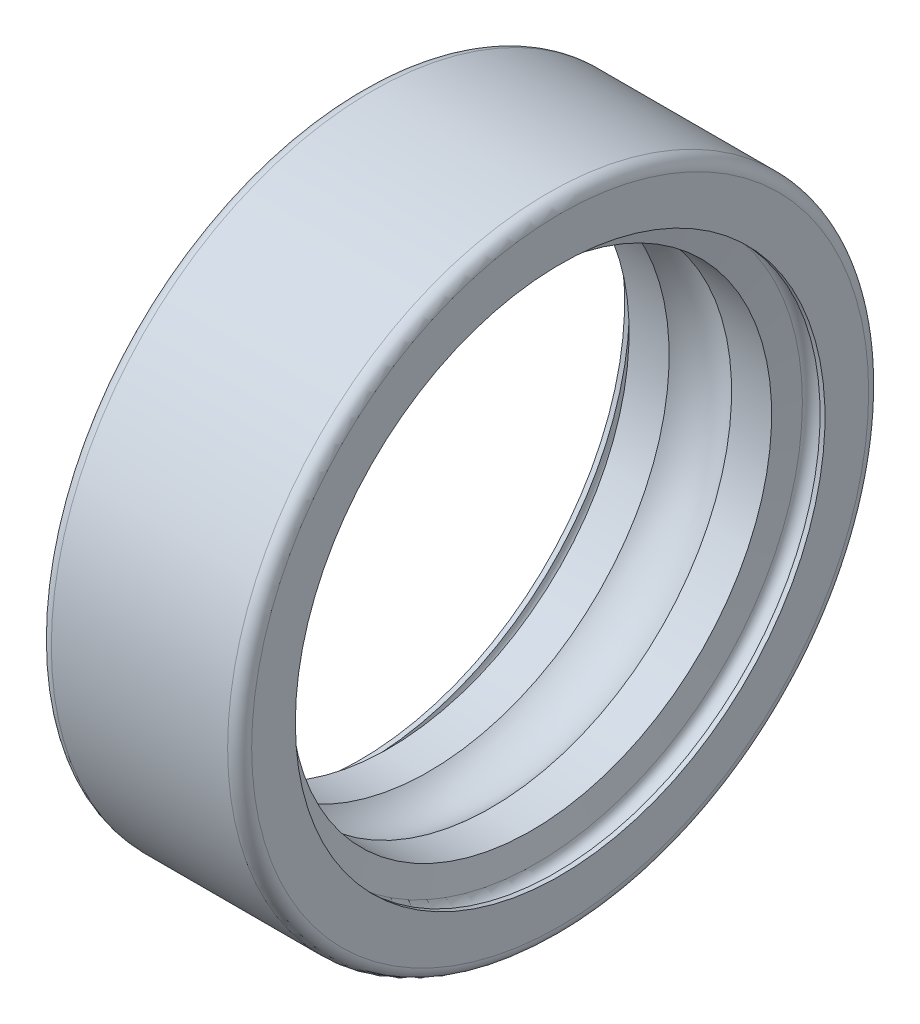
ISO-10303-21;
HEADER;
FILE_DESCRIPTION(('STEP AP214'),'2;1');
FILE_NAME('part.step','',(''),(''),'','','');
FILE_SCHEMA(('AUTOMOTIVE_DESIGN { 1 0 10303 214 1 1 1 1 }'));
ENDSEC;
DATA;
#1=APPLICATION_CONTEXT('core data for automotive mechanical design processes');
#2=APPLICATION_PROTOCOL_DEFINITION('international standard','automotive_design',2000,#1);
#3=PRODUCT_CONTEXT('',#1,'mechanical');
#4=PRODUCT('Part','Part','',(#3));
#5=PRODUCT_RELATED_PRODUCT_CATEGORY('part','',(#4));
#6=PRODUCT_DEFINITION_FORMATION('','',#4);
#7=PRODUCT_DEFINITION_CONTEXT('part definition',#1,'design');
#8=PRODUCT_DEFINITION('design','',#6,#7);
#9=PRODUCT_DEFINITION_SHAPE('','',#8);
#10=(LENGTH_UNIT() NAMED_UNIT(*) SI_UNIT(.MILLI.,.METRE.));
#11=(NAMED_UNIT(*) PLANE_ANGLE_UNIT() SI_UNIT($,.RADIAN.));
#12=(NAMED_UNIT(*) SI_UNIT($,.STERADIAN.) SOLID_ANGLE_UNIT());
#13=UNCERTAINTY_MEASURE_WITH_UNIT(LENGTH_MEASURE(1.E-05),#10,'distance_accuracy_value','');
#14=(GEOMETRIC_REPRESENTATION_CONTEXT(3) GLOBAL_UNCERTAINTY_ASSIGNED_CONTEXT((#13)) GLOBAL_UNIT_ASSIGNED_CONTEXT((#10,
#11,#12)) REPRESENTATION_CONTEXT('',''));
#15=CARTESIAN_POINT('',(0.,0.,0.));
#16=DIRECTION('',(0.,0.,1.));
#17=DIRECTION('',(1.,0.,0.));
#18=AXIS2_PLACEMENT_3D('',#15,#16,#17);
#19=CARTESIAN_POINT('',(4.27867644846772,0.,0.));
#20=DIRECTION('',(1.,0.,0.));
#21=DIRECTION('',(0.,0.,-1.));
#22=AXIS2_PLACEMENT_3D('',#19,#20,#21);
#23=CONICAL_SURFACE('',#22,6.,1.39626340159546);
#24=CARTESIAN_POINT('',(4.39370690826502,0.,0.));
#25=DIRECTION('',(-1.,0.,0.));
#26=DIRECTION('',(0.,0.,1.));
#27=AXIS2_PLACEMENT_3D('',#24,#25,#26);
#28=CIRCLE('',#27,6.65237015535073);
#29=CARTESIAN_POINT('',(4.39370690826502,0.,6.65237015535073));
#30=VERTEX_POINT('',#29);
#31=EDGE_CURVE('E10',#30,#30,#28,.T.);
#32=ORIENTED_EDGE('',*,*,#31,.F.);
#33=EDGE_LOOP('',(#32));
#34=FACE_BOUND('',#33,.T.);
#35=CARTESIAN_POINT('',(4.27867644846772,0.,0.));
#36=DIRECTION('',(-1.,0.,0.));
#37=DIRECTION('',(0.,0.,1.));
#38=AXIS2_PLACEMENT_3D('',#35,#36,#37);
#39=CIRCLE('',#38,6.);
#40=CARTESIAN_POINT('',(4.27867644846772,0.,6.));
#41=VERTEX_POINT('',#40);
#42=EDGE_CURVE('E80',#41,#41,#39,.T.);
#43=ORIENTED_EDGE('',*,*,#42,.T.);
#44=EDGE_LOOP('',(#43));
#45=FACE_BOUND('',#44,.T.);
#46=ADVANCED_FACE('F14',(#34,#45),#23,.F.);
#47=CARTESIAN_POINT('',(4.634,0.,0.));
#48=DIRECTION('',(-1.,0.,0.));
#49=DIRECTION('',(0.,0.,1.));
#50=AXIS2_PLACEMENT_3D('',#47,#48,#49);
#51=TOROIDAL_SURFACE('',#50,6.61,0.244);
#52=ORIENTED_EDGE('',*,*,#31,.T.);
#53=EDGE_LOOP('',(#52));
#54=FACE_BOUND('',#53,.T.);
#55=CARTESIAN_POINT('',(4.878,0.,0.));
#56=DIRECTION('',(-1.,0.,0.));
#57=DIRECTION('',(0.,0.,1.));
#58=AXIS2_PLACEMENT_3D('',#55,#56,#57);
#59=CIRCLE('',#58,6.61);
#60=CARTESIAN_POINT('',(4.878,0.,6.61));
#61=VERTEX_POINT('',#60);
#62=EDGE_CURVE('E21',#61,#61,#59,.T.);
#63=ORIENTED_EDGE('',*,*,#62,.F.);
#64=EDGE_LOOP('',(#63));
#65=FACE_BOUND('',#64,.T.);
#66=ADVANCED_FACE('F105',(#54,#65),#51,.F.);
#67=CARTESIAN_POINT('',(0.,0.,0.));
#68=DIRECTION('',(-1.,0.,0.));
#69=DIRECTION('',(0.,0.,1.));
#70=AXIS2_PLACEMENT_3D('',#67,#68,#69);
#71=CYLINDRICAL_SURFACE('',#70,6.61);
#72=ORIENTED_EDGE('',*,*,#62,.T.);
#73=EDGE_LOOP('',(#72));
#74=FACE_BOUND('',#73,.T.);
#75=CARTESIAN_POINT('',(5.,0.,0.));
#76=DIRECTION('',(-1.,0.,0.));
#77=DIRECTION('',(0.,0.,1.));
#78=AXIS2_PLACEMENT_3D('',#75,#76,#77);
#79=CIRCLE('',#78,6.61);
#80=CARTESIAN_POINT('',(5.,0.,6.61));
#81=VERTEX_POINT('',#80);
#82=EDGE_CURVE('E30',#81,#81,#79,.T.);
#83=ORIENTED_EDGE('',*,*,#82,.F.);
#84=EDGE_LOOP('',(#83));
#85=FACE_BOUND('',#84,.T.);
#86=ADVANCED_FACE('F110',(#74,#85),#71,.F.);
#87=CARTESIAN_POINT('',(5.,6.61,0.));
#88=DIRECTION('',(-1.,0.,0.));
#89=DIRECTION('',(0.,0.,1.));
#90=AXIS2_PLACEMENT_3D('',#87,#88,#89);
#91=PLANE('',#90);
#92=CARTESIAN_POINT('',(5.,0.,0.));
#93=DIRECTION('',(-1.,0.,0.));
#94=DIRECTION('',(0.,0.,1.));
#95=AXIS2_PLACEMENT_3D('',#92,#93,#94);
#96=CIRCLE('',#95,7.7);
#97=CARTESIAN_POINT('',(5.,0.,7.7));
#98=VERTEX_POINT('',#97);
#99=EDGE_CURVE('E38',#98,#98,#96,.T.);
#100=ORIENTED_EDGE('',*,*,#99,.F.);
#101=EDGE_LOOP('',(#100));
#102=FACE_BOUND('',#101,.T.);
#103=ORIENTED_EDGE('',*,*,#82,.T.);
#104=EDGE_LOOP('',(#103));
#105=FACE_BOUND('',#104,.T.);
#106=ADVANCED_FACE('F114',(#102,#105),#91,.F.);
#107=CARTESIAN_POINT('',(4.7,0.,0.));
#108=DIRECTION('',(-1.,0.,0.));
#109=DIRECTION('',(0.,0.,1.));
#110=AXIS2_PLACEMENT_3D('',#107,#108,#109);
#111=TOROIDAL_SURFACE('',#110,7.7,0.3);
#112=CARTESIAN_POINT('',(4.7,0.,0.));
#113=DIRECTION('',(-1.,0.,0.));
#114=DIRECTION('',(0.,0.,1.));
#115=AXIS2_PLACEMENT_3D('',#112,#113,#114);
#116=CIRCLE('',#115,8.);
#117=CARTESIAN_POINT('',(4.7,0.,8.));
#118=VERTEX_POINT('',#117);
#119=EDGE_CURVE('E44',#118,#118,#116,.T.);
#120=ORIENTED_EDGE('',*,*,#119,.F.);
#121=EDGE_LOOP('',(#120));
#122=FACE_BOUND('',#121,.T.);
#123=ORIENTED_EDGE('',*,*,#99,.T.);
#124=EDGE_LOOP('',(#123));
#125=FACE_BOUND('',#124,.T.);
#126=ADVANCED_FACE('F120',(#122,#125),#111,.T.);
#127=CARTESIAN_POINT('',(0.,0.,0.));
#128=DIRECTION('',(-1.,0.,0.));
#129=DIRECTION('',(0.,0.,1.));
#130=AXIS2_PLACEMENT_3D('',#127,#128,#129);
#131=CYLINDRICAL_SURFACE('',#130,8.);
#132=ORIENTED_EDGE('',*,*,#119,.T.);
#133=EDGE_LOOP('',(#132));
#134=FACE_BOUND('',#133,.T.);
#135=CARTESIAN_POINT('',(0.3,0.,0.));
#136=DIRECTION('',(-1.,0.,0.));
#137=DIRECTION('',(0.,0.,1.));
#138=AXIS2_PLACEMENT_3D('',#135,#136,#137);
#139=CIRCLE('',#138,8.);
#140=CARTESIAN_POINT('',(0.3,0.,8.));
#141=VERTEX_POINT('',#140);
#142=EDGE_CURVE('E48',#141,#141,#139,.T.);
#143=ORIENTED_EDGE('',*,*,#142,.F.);
#144=EDGE_LOOP('',(#143));
#145=FACE_BOUND('',#144,.T.);
#146=ADVANCED_FACE('F124',(#134,#145),#131,.T.);
#147=CARTESIAN_POINT('',(0.3,0.,0.));
#148=DIRECTION('',(-1.,0.,0.));
#149=DIRECTION('',(0.,0.,1.));
#150=AXIS2_PLACEMENT_3D('',#147,#148,#149);
#151=TOROIDAL_SURFACE('',#150,7.7,0.3);
#152=CARTESIAN_POINT('',(0.,0.,0.));
#153=DIRECTION('',(-1.,0.,0.));
#154=DIRECTION('',(0.,0.,1.));
#155=AXIS2_PLACEMENT_3D('',#152,#153,#154);
#156=CIRCLE('',#155,7.7);
#157=CARTESIAN_POINT('',(0.,0.,7.7));
#158=VERTEX_POINT('',#157);
#159=EDGE_CURVE('E52',#158,#158,#156,.T.);
#160=ORIENTED_EDGE('',*,*,#159,.F.);
#161=EDGE_LOOP('',(#160));
#162=FACE_BOUND('',#161,.T.);
#163=ORIENTED_EDGE('',*,*,#142,.T.);
#164=EDGE_LOOP('',(#163));
#165=FACE_BOUND('',#164,.T.);
#166=ADVANCED_FACE('F128',(#162,#165),#151,.T.);
#167=CARTESIAN_POINT('',(0.,6.61,0.));
#168=DIRECTION('',(-1.,0.,0.));
#169=DIRECTION('',(0.,0.,1.));
#170=AXIS2_PLACEMENT_3D('',#167,#168,#169);
#171=PLANE('',#170);
#172=ORIENTED_EDGE('',*,*,#159,.T.);
#173=EDGE_LOOP('',(#172));
#174=FACE_BOUND('',#173,.T.);
#175=CARTESIAN_POINT('',(0.,0.,0.));
#176=DIRECTION('',(-1.,0.,0.));
#177=DIRECTION('',(0.,0.,1.));
#178=AXIS2_PLACEMENT_3D('',#175,#176,#177);
#179=CIRCLE('',#178,6.61);
#180=CARTESIAN_POINT('',(0.,0.,6.61));
#181=VERTEX_POINT('',#180);
#182=EDGE_CURVE('E56',#181,#181,#179,.T.);
#183=ORIENTED_EDGE('',*,*,#182,.F.);
#184=EDGE_LOOP('',(#183));
#185=FACE_BOUND('',#184,.T.);
#186=ADVANCED_FACE('F132',(#174,#185),#171,.T.);
#187=CARTESIAN_POINT('',(0.,0.,0.));
#188=DIRECTION('',(-1.,0.,0.));
#189=DIRECTION('',(0.,0.,1.));
#190=AXIS2_PLACEMENT_3D('',#187,#188,#189);
#191=CYLINDRICAL_SURFACE('',#190,6.61);
#192=CARTESIAN_POINT('',(0.122,0.,0.));
#193=DIRECTION('',(-1.,0.,0.));
#194=DIRECTION('',(0.,0.,1.));
#195=AXIS2_PLACEMENT_3D('',#192,#193,#194);
#196=CIRCLE('',#195,6.61);
#197=CARTESIAN_POINT('',(0.122,0.,6.61));
#198=VERTEX_POINT('',#197);
#199=EDGE_CURVE('E60',#198,#198,#196,.T.);
#200=ORIENTED_EDGE('',*,*,#199,.F.);
#201=EDGE_LOOP('',(#200));
#202=FACE_BOUND('',#201,.T.);
#203=ORIENTED_EDGE('',*,*,#182,.T.);
#204=EDGE_LOOP('',(#203));
#205=FACE_BOUND('',#204,.T.);
#206=ADVANCED_FACE('F136',(#202,#205),#191,.F.);
#207=CARTESIAN_POINT('',(0.366,0.,0.));
#208=DIRECTION('',(-1.,0.,0.));
#209=DIRECTION('',(0.,0.,1.));
#210=AXIS2_PLACEMENT_3D('',#207,#208,#209);
#211=TOROIDAL_SURFACE('',#210,6.61,0.244);
#212=ORIENTED_EDGE('',*,*,#199,.T.);
#213=EDGE_LOOP('',(#212));
#214=FACE_BOUND('',#213,.T.);
#215=CARTESIAN_POINT('',(0.606293091734979,0.,0.));
#216=DIRECTION('',(-1.,0.,0.));
#217=DIRECTION('',(0.,0.,1.));
#218=AXIS2_PLACEMENT_3D('',#215,#216,#217);
#219=CIRCLE('',#218,6.65237015535073);
#220=CARTESIAN_POINT('',(0.606293091734979,0.,6.65237015535073));
#221=VERTEX_POINT('',#220);
#222=EDGE_CURVE('E64',#221,#221,#219,.T.);
#223=ORIENTED_EDGE('',*,*,#222,.F.);
#224=EDGE_LOOP('',(#223));
#225=FACE_BOUND('',#224,.T.);
#226=ADVANCED_FACE('F140',(#214,#225),#211,.F.);
#227=CARTESIAN_POINT('',(0.721323551532286,0.,0.));
#228=DIRECTION('',(-1.,0.,0.));
#229=DIRECTION('',(0.,0.,1.));
#230=AXIS2_PLACEMENT_3D('',#227,#228,#229);
#231=CONICAL_SURFACE('',#230,6.,1.39626340159546);
#232=ORIENTED_EDGE('',*,*,#222,.T.);
#233=EDGE_LOOP('',(#232));
#234=FACE_BOUND('',#233,.T.);
#235=CARTESIAN_POINT('',(0.721323551532286,0.,0.));
#236=DIRECTION('',(-1.,0.,0.));
#237=DIRECTION('',(0.,0.,1.));
#238=AXIS2_PLACEMENT_3D('',#235,#236,#237);
#239=CIRCLE('',#238,6.);
#240=CARTESIAN_POINT('',(0.721323551532286,0.,6.));
#241=VERTEX_POINT('',#240);
#242=EDGE_CURVE('E68',#241,#241,#239,.T.);
#243=ORIENTED_EDGE('',*,*,#242,.F.);
#244=EDGE_LOOP('',(#243));
#245=FACE_BOUND('',#244,.T.);
#246=ADVANCED_FACE('F101',(#234,#245),#231,.F.);
#247=CARTESIAN_POINT('',(0.,0.,0.));
#248=DIRECTION('',(-1.,0.,0.));
#249=DIRECTION('',(0.,0.,1.));
#250=AXIS2_PLACEMENT_3D('',#247,#248,#249);
#251=CYLINDRICAL_SURFACE('',#250,6.);
#252=CARTESIAN_POINT('',(1.72071170289809,0.,0.));
#253=DIRECTION('',(-1.,0.,0.));
#254=DIRECTION('',(0.,0.,1.));
#255=AXIS2_PLACEMENT_3D('',#252,#253,#254);
#256=CIRCLE('',#255,6.);
#257=CARTESIAN_POINT('',(1.72071170289809,0.,6.));
#258=VERTEX_POINT('',#257);
#259=EDGE_CURVE('E72',#258,#258,#256,.T.);
#260=ORIENTED_EDGE('',*,*,#259,.F.);
#261=EDGE_LOOP('',(#260));
#262=FACE_BOUND('',#261,.T.);
#263=ORIENTED_EDGE('',*,*,#242,.T.);
#264=EDGE_LOOP('',(#263));
#265=FACE_BOUND('',#264,.T.);
#266=ADVANCED_FACE('F94',(#262,#265),#251,.F.);
#267=CARTESIAN_POINT('',(2.5,0.,0.));
#268=DIRECTION('',(-1.,0.,0.));
#269=DIRECTION('',(0.,0.,1.));
#270=AXIS2_PLACEMENT_3D('',#267,#268,#269);
#271=TOROIDAL_SURFACE('',#270,5.1,1.1905);
#272=ORIENTED_EDGE('',*,*,#259,.T.);
#273=EDGE_LOOP('',(#272));
#274=FACE_BOUND('',#273,.T.);
#275=CARTESIAN_POINT('',(3.27928829710191,0.,0.));
#276=DIRECTION('',(-1.,0.,0.));
#277=DIRECTION('',(0.,0.,1.));
#278=AXIS2_PLACEMENT_3D('',#275,#276,#277);
#279=CIRCLE('',#278,6.);
#280=CARTESIAN_POINT('',(3.27928829710191,0.,6.));
#281=VERTEX_POINT('',#280);
#282=EDGE_CURVE('E76',#281,#281,#279,.T.);
#283=ORIENTED_EDGE('',*,*,#282,.F.);
#284=EDGE_LOOP('',(#283));
#285=FACE_BOUND('',#284,.T.);
#286=ADVANCED_FACE('F89',(#274,#285),#271,.F.);
#287=CARTESIAN_POINT('',(0.,0.,0.));
#288=DIRECTION('',(-1.,0.,0.));
#289=DIRECTION('',(0.,0.,1.));
#290=AXIS2_PLACEMENT_3D('',#287,#288,#289);
#291=CYLINDRICAL_SURFACE('',#290,6.);
#292=ORIENTED_EDGE('',*,*,#42,.F.);
#293=EDGE_LOOP('',(#292));
#294=FACE_BOUND('',#293,.T.);
#295=ORIENTED_EDGE('',*,*,#282,.T.);
#296=EDGE_LOOP('',(#295));
#297=FACE_BOUND('',#296,.T.);
#298=ADVANCED_FACE('F86',(#294,#297),#291,.F.);
#299=CLOSED_SHELL('',(#46,#66,#86,#106,#126,#146,#166,#186,#206,#226,#246,#266,#286,#298));
#300=MANIFOLD_SOLID_BREP('B1',#299);
#301=ADVANCED_BREP_SHAPE_REPRESENTATION('',(#18,#300),#14);
#302=SHAPE_DEFINITION_REPRESENTATION(#9,#301);
ENDSEC;
END-ISO-10303-21;
